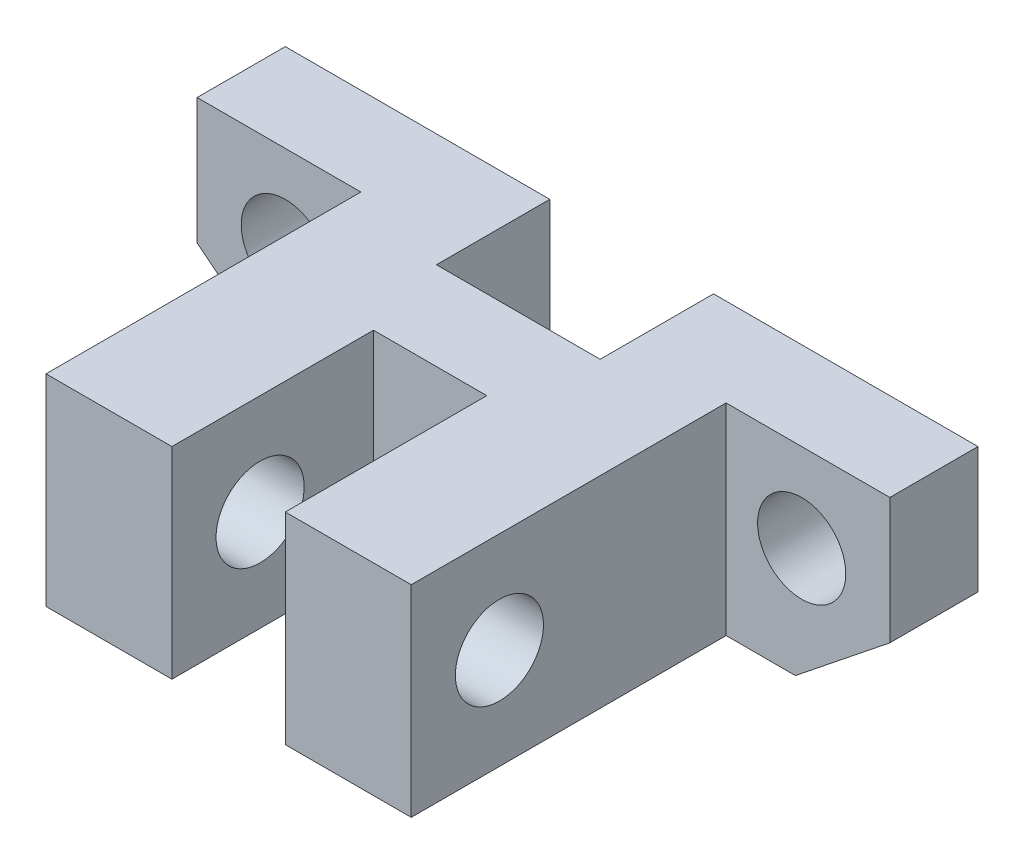
ISO-10303-21;
HEADER;
FILE_DESCRIPTION(('STEP AP214'),'2;1');
FILE_NAME('part.step','',(''),(''),'','','');
FILE_SCHEMA(('AUTOMOTIVE_DESIGN { 1 0 10303 214 1 1 1 1 }'));
ENDSEC;
DATA;
#1=APPLICATION_CONTEXT('core data for automotive mechanical design processes');
#2=APPLICATION_PROTOCOL_DEFINITION('international standard','automotive_design',2000,#1);
#3=PRODUCT_CONTEXT('',#1,'mechanical');
#4=PRODUCT('Part','Part','',(#3));
#5=PRODUCT_RELATED_PRODUCT_CATEGORY('part','',(#4));
#6=PRODUCT_DEFINITION_FORMATION('','',#4);
#7=PRODUCT_DEFINITION_CONTEXT('part definition',#1,'design');
#8=PRODUCT_DEFINITION('design','',#6,#7);
#9=PRODUCT_DEFINITION_SHAPE('','',#8);
#10=(LENGTH_UNIT() NAMED_UNIT(*) SI_UNIT(.MILLI.,.METRE.));
#11=(NAMED_UNIT(*) PLANE_ANGLE_UNIT() SI_UNIT($,.RADIAN.));
#12=(NAMED_UNIT(*) SI_UNIT($,.STERADIAN.) SOLID_ANGLE_UNIT());
#13=UNCERTAINTY_MEASURE_WITH_UNIT(LENGTH_MEASURE(1.E-05),#10,'distance_accuracy_value','');
#14=(GEOMETRIC_REPRESENTATION_CONTEXT(3) GLOBAL_UNCERTAINTY_ASSIGNED_CONTEXT((#13)) GLOBAL_UNIT_ASSIGNED_CONTEXT((#10,
#11,#12)) REPRESENTATION_CONTEXT('',''));
#15=CARTESIAN_POINT('',(0.,0.,0.));
#16=DIRECTION('',(0.,0.,1.));
#17=DIRECTION('',(1.,0.,0.));
#18=AXIS2_PLACEMENT_3D('',#15,#16,#17);
#19=CARTESIAN_POINT('',(0.,0.,32.));
#20=DIRECTION('',(0.,0.,1.));
#21=DIRECTION('',(1.,0.,0.));
#22=AXIS2_PLACEMENT_3D('',#19,#20,#21);
#23=PLANE('',#22);
#24=DIRECTION('',(0.,1.,0.));
#25=VECTOR('',#24,1.);
#26=CARTESIAN_POINT('',(4.5,0.,32.));
#27=LINE('',#26,#25);
#28=CARTESIAN_POINT('',(4.5,-11.,32.));
#29=VERTEX_POINT('',#28);
#30=CARTESIAN_POINT('',(4.5,5.,32.));
#31=VERTEX_POINT('',#30);
#32=EDGE_CURVE('E210',#29,#31,#27,.T.);
#33=ORIENTED_EDGE('',*,*,#32,.F.);
#34=DIRECTION('',(1.,0.,0.));
#35=VECTOR('',#34,1.);
#36=CARTESIAN_POINT('',(-20.,-11.,32.));
#37=LINE('',#36,#35);
#38=CARTESIAN_POINT('',(14.5,-11.,32.));
#39=VERTEX_POINT('',#38);
#40=EDGE_CURVE('E294',#29,#39,#37,.T.);
#41=ORIENTED_EDGE('',*,*,#40,.T.);
#42=DIRECTION('',(0.,1.,0.));
#43=VECTOR('',#42,1.);
#44=CARTESIAN_POINT('',(14.5,0.,32.));
#45=LINE('',#44,#43);
#46=CARTESIAN_POINT('',(14.5,5.,32.));
#47=VERTEX_POINT('',#46);
#48=EDGE_CURVE('E344',#39,#47,#45,.T.);
#49=ORIENTED_EDGE('',*,*,#48,.T.);
#50=DIRECTION('',(-1.,0.,0.));
#51=VECTOR('',#50,1.);
#52=CARTESIAN_POINT('',(-27.5,5.,32.));
#53=LINE('',#52,#51);
#54=EDGE_CURVE('E290',#47,#31,#53,.T.);
#55=ORIENTED_EDGE('',*,*,#54,.T.);
#56=EDGE_LOOP('',(#33,#41,#49,#55));
#57=FACE_BOUND('',#56,.T.);
#58=ADVANCED_FACE('F45',(#57),#23,.T.);
#59=CARTESIAN_POINT('',(0.,0.,0.));
#60=DIRECTION('',(0.,0.,1.));
#61=DIRECTION('',(1.,0.,0.));
#62=AXIS2_PLACEMENT_3D('',#59,#60,#61);
#63=PLANE('',#62);
#64=CARTESIAN_POINT('',(20.5,-2.,0.));
#65=DIRECTION('',(0.,0.,1.));
#66=DIRECTION('',(1.,0.,0.));
#67=AXIS2_PLACEMENT_3D('',#64,#65,#66);
#68=CIRCLE('',#67,3.5);
#69=CARTESIAN_POINT('',(24.,-2.,0.));
#70=VERTEX_POINT('',#69);
#71=EDGE_CURVE('E632',#70,#70,#68,.T.);
#72=ORIENTED_EDGE('',*,*,#71,.T.);
#73=EDGE_LOOP('',(#72));
#74=FACE_BOUND('',#73,.T.);
#75=DIRECTION('',(1.,0.,0.));
#76=VECTOR('',#75,1.);
#77=CARTESIAN_POINT('',(-20.,-11.,0.));
#78=LINE('',#77,#76);
#79=CARTESIAN_POINT('',(6.5,-11.,0.));
#80=VERTEX_POINT('',#79);
#81=CARTESIAN_POINT('',(20.,-11.,0.));
#82=VERTEX_POINT('',#81);
#83=EDGE_CURVE('E320',#80,#82,#78,.T.);
#84=ORIENTED_EDGE('',*,*,#83,.F.);
#85=DIRECTION('',(0.,-1.,0.));
#86=VECTOR('',#85,1.);
#87=CARTESIAN_POINT('',(6.5,5.,0.));
#88=LINE('',#87,#86);
#89=CARTESIAN_POINT('',(6.5,5.,0.));
#90=VERTEX_POINT('',#89);
#91=EDGE_CURVE('E236',#90,#80,#88,.T.);
#92=ORIENTED_EDGE('',*,*,#91,.F.);
#93=DIRECTION('',(-1.,0.,0.));
#94=VECTOR('',#93,1.);
#95=CARTESIAN_POINT('',(-27.5,5.,0.));
#96=LINE('',#95,#94);
#97=CARTESIAN_POINT('',(27.5,5.,0.));
#98=VERTEX_POINT('',#97);
#99=EDGE_CURVE('E308',#98,#90,#96,.T.);
#100=ORIENTED_EDGE('',*,*,#99,.F.);
#101=DIRECTION('',(0.,1.,0.));
#102=VECTOR('',#101,1.);
#103=CARTESIAN_POINT('',(27.5,5.,0.));
#104=LINE('',#103,#102);
#105=CARTESIAN_POINT('',(27.5,-5.,0.));
#106=VERTEX_POINT('',#105);
#107=EDGE_CURVE('E303',#106,#98,#104,.T.);
#108=ORIENTED_EDGE('',*,*,#107,.F.);
#109=DIRECTION('',(0.780868809443031,0.624695047554424,0.));
#110=VECTOR('',#109,1.);
#111=CARTESIAN_POINT('',(20.,-11.,0.));
#112=LINE('',#111,#110);
#113=EDGE_CURVE('E289',#82,#106,#112,.T.);
#114=ORIENTED_EDGE('',*,*,#113,.F.);
#115=EDGE_LOOP('',(#84,#92,#100,#108,#114));
#116=FACE_BOUND('',#115,.T.);
#117=ADVANCED_FACE('F387',(#74,#116),#63,.F.);
#118=DIRECTION('',(0.,-1.,0.));
#119=VECTOR('',#118,1.);
#120=CARTESIAN_POINT('',(-4.5,0.,32.));
#121=LINE('',#120,#119);
#122=CARTESIAN_POINT('',(-4.5,5.,32.));
#123=VERTEX_POINT('',#122);
#124=CARTESIAN_POINT('',(-4.5,-11.,32.));
#125=VERTEX_POINT('',#124);
#126=EDGE_CURVE('E62',#123,#125,#121,.T.);
#127=ORIENTED_EDGE('',*,*,#126,.F.);
#128=CARTESIAN_POINT('',(-14.5,5.,32.));
#129=VERTEX_POINT('',#128);
#130=EDGE_CURVE('E191',#123,#129,#53,.T.);
#131=ORIENTED_EDGE('',*,*,#130,.T.);
#132=DIRECTION('',(0.,-1.,0.));
#133=VECTOR('',#132,1.);
#134=CARTESIAN_POINT('',(-14.5,0.,32.));
#135=LINE('',#134,#133);
#136=CARTESIAN_POINT('',(-14.5,-11.,32.));
#137=VERTEX_POINT('',#136);
#138=EDGE_CURVE('E251',#129,#137,#135,.T.);
#139=ORIENTED_EDGE('',*,*,#138,.T.);
#140=EDGE_CURVE('E295',#137,#125,#37,.T.);
#141=ORIENTED_EDGE('',*,*,#140,.T.);
#142=EDGE_LOOP('',(#127,#131,#139,#141));
#143=FACE_BOUND('',#142,.T.);
#144=ADVANCED_FACE('F411',(#143),#23,.T.);
#145=CARTESIAN_POINT('',(20.,-11.,32.));
#146=DIRECTION('',(-0.624695047554424,0.780868809443031,0.));
#147=DIRECTION('',(-0.780868809443031,-0.624695047554424,0.));
#148=AXIS2_PLACEMENT_3D('',#145,#146,#147);
#149=PLANE('',#148);
#150=DIRECTION('',(0.,0.,-1.));
#151=VECTOR('',#150,1.);
#152=CARTESIAN_POINT('',(27.5,-5.,32.));
#153=LINE('',#152,#151);
#154=CARTESIAN_POINT('',(27.5,-5.,7.));
#155=VERTEX_POINT('',#154);
#156=EDGE_CURVE('E341',#155,#106,#153,.T.);
#157=ORIENTED_EDGE('',*,*,#156,.F.);
#158=DIRECTION('',(-0.780868809443031,-0.624695047554424,0.));
#159=VECTOR('',#158,1.);
#160=CARTESIAN_POINT('',(20.,-11.,6.99999999999999));
#161=LINE('',#160,#159);
#162=CARTESIAN_POINT('',(20.,-11.,7.));
#163=VERTEX_POINT('',#162);
#164=EDGE_CURVE('E281',#155,#163,#161,.T.);
#165=ORIENTED_EDGE('',*,*,#164,.T.);
#166=DIRECTION('',(0.,0.,-1.));
#167=VECTOR('',#166,1.);
#168=CARTESIAN_POINT('',(20.,-11.,32.));
#169=LINE('',#168,#167);
#170=EDGE_CURVE('E299',#163,#82,#169,.T.);
#171=ORIENTED_EDGE('',*,*,#170,.T.);
#172=ORIENTED_EDGE('',*,*,#113,.T.);
#173=EDGE_LOOP('',(#157,#165,#171,#172));
#174=FACE_BOUND('',#173,.T.);
#175=ADVANCED_FACE('F47',(#174),#149,.F.);
#176=CARTESIAN_POINT('',(27.5,5.,32.));
#177=DIRECTION('',(-1.,0.,0.));
#178=DIRECTION('',(0.,0.,1.));
#179=AXIS2_PLACEMENT_3D('',#176,#177,#178);
#180=PLANE('',#179);
#181=DIRECTION('',(0.,0.,-1.));
#182=VECTOR('',#181,1.);
#183=CARTESIAN_POINT('',(27.5,5.,32.));
#184=LINE('',#183,#182);
#185=CARTESIAN_POINT('',(27.5,5.,7.));
#186=VERTEX_POINT('',#185);
#187=EDGE_CURVE('E338',#186,#98,#184,.T.);
#188=ORIENTED_EDGE('',*,*,#187,.F.);
#189=DIRECTION('',(0.,1.,0.));
#190=VECTOR('',#189,1.);
#191=CARTESIAN_POINT('',(27.5,16.7277578085355,7.));
#192=LINE('',#191,#190);
#193=EDGE_CURVE('E268',#155,#186,#192,.T.);
#194=ORIENTED_EDGE('',*,*,#193,.F.);
#195=ORIENTED_EDGE('',*,*,#156,.T.);
#196=ORIENTED_EDGE('',*,*,#107,.T.);
#197=EDGE_LOOP('',(#188,#194,#195,#196));
#198=FACE_BOUND('',#197,.T.);
#199=ADVANCED_FACE('F394',(#198),#180,.F.);
#200=CARTESIAN_POINT('',(-27.5,5.,32.));
#201=DIRECTION('',(0.,-1.,0.));
#202=DIRECTION('',(0.,0.,-1.));
#203=AXIS2_PLACEMENT_3D('',#200,#201,#202);
#204=PLANE('',#203);
#205=DIRECTION('',(1.,0.,0.));
#206=VECTOR('',#205,1.);
#207=CARTESIAN_POINT('',(-4.5,5.,16.));
#208=LINE('',#207,#206);
#209=CARTESIAN_POINT('',(-4.5,5.,16.));
#210=VERTEX_POINT('',#209);
#211=CARTESIAN_POINT('',(4.5,5.,16.));
#212=VERTEX_POINT('',#211);
#213=EDGE_CURVE('E179',#210,#212,#208,.T.);
#214=ORIENTED_EDGE('',*,*,#213,.T.);
#215=DIRECTION('',(0.,0.,1.));
#216=VECTOR('',#215,1.);
#217=CARTESIAN_POINT('',(4.5,5.,16.));
#218=LINE('',#217,#216);
#219=EDGE_CURVE('E193',#212,#31,#218,.T.);
#220=ORIENTED_EDGE('',*,*,#219,.T.);
#221=ORIENTED_EDGE('',*,*,#54,.F.);
#222=DIRECTION('',(0.,0.,1.));
#223=VECTOR('',#222,1.);
#224=CARTESIAN_POINT('',(14.5,5.,32.));
#225=LINE('',#224,#223);
#226=CARTESIAN_POINT('',(14.5,5.,7.));
#227=VERTEX_POINT('',#226);
#228=EDGE_CURVE('E278',#227,#47,#225,.T.);
#229=ORIENTED_EDGE('',*,*,#228,.F.);
#230=DIRECTION('',(1.,0.,0.));
#231=VECTOR('',#230,1.);
#232=CARTESIAN_POINT('',(-27.5,5.,7.));
#233=LINE('',#232,#231);
#234=EDGE_CURVE('E285',#227,#186,#233,.T.);
#235=ORIENTED_EDGE('',*,*,#234,.T.);
#236=ORIENTED_EDGE('',*,*,#187,.T.);
#237=ORIENTED_EDGE('',*,*,#99,.T.);
#238=DIRECTION('',(0.,0.,1.));
#239=VECTOR('',#238,1.);
#240=CARTESIAN_POINT('',(6.5,5.,9.));
#241=LINE('',#240,#239);
#242=CARTESIAN_POINT('',(6.5,5.,9.));
#243=VERTEX_POINT('',#242);
#244=EDGE_CURVE('E214',#90,#243,#241,.T.);
#245=ORIENTED_EDGE('',*,*,#244,.T.);
#246=DIRECTION('',(-1.,0.,0.));
#247=VECTOR('',#246,1.);
#248=CARTESIAN_POINT('',(-6.5,5.,9.));
#249=LINE('',#248,#247);
#250=CARTESIAN_POINT('',(-6.5,5.,9.));
#251=VERTEX_POINT('',#250);
#252=EDGE_CURVE('E218',#243,#251,#249,.T.);
#253=ORIENTED_EDGE('',*,*,#252,.T.);
#254=DIRECTION('',(0.,0.,-1.));
#255=VECTOR('',#254,1.);
#256=CARTESIAN_POINT('',(-6.5,5.,9.));
#257=LINE('',#256,#255);
#258=CARTESIAN_POINT('',(-6.5,5.,0.));
#259=VERTEX_POINT('',#258);
#260=EDGE_CURVE('E222',#251,#259,#257,.T.);
#261=ORIENTED_EDGE('',*,*,#260,.T.);
#262=CARTESIAN_POINT('',(-27.5,5.,0.));
#263=VERTEX_POINT('',#262);
#264=EDGE_CURVE('E307',#259,#263,#96,.T.);
#265=ORIENTED_EDGE('',*,*,#264,.T.);
#266=DIRECTION('',(0.,0.,-1.));
#267=VECTOR('',#266,1.);
#268=CARTESIAN_POINT('',(-27.5,5.,32.));
#269=LINE('',#268,#267);
#270=CARTESIAN_POINT('',(-27.5,5.,7.));
#271=VERTEX_POINT('',#270);
#272=EDGE_CURVE('E334',#271,#263,#269,.T.);
#273=ORIENTED_EDGE('',*,*,#272,.F.);
#274=DIRECTION('',(1.,0.,0.));
#275=VECTOR('',#274,1.);
#276=CARTESIAN_POINT('',(-27.5,5.,7.));
#277=LINE('',#276,#275);
#278=CARTESIAN_POINT('',(-14.5,5.,7.));
#279=VERTEX_POINT('',#278);
#280=EDGE_CURVE('E264',#271,#279,#277,.T.);
#281=ORIENTED_EDGE('',*,*,#280,.T.);
#282=DIRECTION('',(0.,0.,-1.));
#283=VECTOR('',#282,1.);
#284=CARTESIAN_POINT('',(-14.5,5.,32.));
#285=LINE('',#284,#283);
#286=EDGE_CURVE('E257',#129,#279,#285,.T.);
#287=ORIENTED_EDGE('',*,*,#286,.F.);
#288=ORIENTED_EDGE('',*,*,#130,.F.);
#289=DIRECTION('',(0.,0.,-1.));
#290=VECTOR('',#289,1.);
#291=CARTESIAN_POINT('',(-4.5,5.,16.));
#292=LINE('',#291,#290);
#293=EDGE_CURVE('E173',#123,#210,#292,.T.);
#294=ORIENTED_EDGE('',*,*,#293,.T.);
#295=EDGE_LOOP('',(#214,#220,#221,#229,#235,#236,#237,#245,#253,#261,#265,#273,#281,#287,#288,#294));
#296=FACE_BOUND('',#295,.T.);
#297=ADVANCED_FACE('F189',(#296),#204,.F.);
#298=CARTESIAN_POINT('',(-27.5,5.,32.));
#299=DIRECTION('',(1.,0.,0.));
#300=DIRECTION('',(0.,0.,-1.));
#301=AXIS2_PLACEMENT_3D('',#298,#299,#300);
#302=PLANE('',#301);
#303=DIRECTION('',(0.,0.,-1.));
#304=VECTOR('',#303,1.);
#305=CARTESIAN_POINT('',(-27.5,-5.,32.));
#306=LINE('',#305,#304);
#307=CARTESIAN_POINT('',(-27.5,-5.,7.));
#308=VERTEX_POINT('',#307);
#309=CARTESIAN_POINT('',(-27.5,-5.,0.));
#310=VERTEX_POINT('',#309);
#311=EDGE_CURVE('E331',#308,#310,#306,.T.);
#312=ORIENTED_EDGE('',*,*,#311,.F.);
#313=DIRECTION('',(0.,-1.,0.));
#314=VECTOR('',#313,1.);
#315=CARTESIAN_POINT('',(-27.5,10.7920474144833,7.));
#316=LINE('',#315,#314);
#317=EDGE_CURVE('E239',#271,#308,#316,.T.);
#318=ORIENTED_EDGE('',*,*,#317,.F.);
#319=ORIENTED_EDGE('',*,*,#272,.T.);
#320=DIRECTION('',(0.,-1.,0.));
#321=VECTOR('',#320,1.);
#322=CARTESIAN_POINT('',(-27.5,5.,0.));
#323=LINE('',#322,#321);
#324=EDGE_CURVE('E312',#263,#310,#323,.T.);
#325=ORIENTED_EDGE('',*,*,#324,.T.);
#326=EDGE_LOOP('',(#312,#318,#319,#325));
#327=FACE_BOUND('',#326,.T.);
#328=ADVANCED_FACE('F405',(#327),#302,.F.);
#329=CARTESIAN_POINT('',(-20.,-11.,32.));
#330=DIRECTION('',(0.624695047554424,0.78086880944303,0.));
#331=DIRECTION('',(-0.78086880944303,0.624695047554424,0.));
#332=AXIS2_PLACEMENT_3D('',#329,#330,#331);
#333=PLANE('',#332);
#334=DIRECTION('',(0.,0.,-1.));
#335=VECTOR('',#334,1.);
#336=CARTESIAN_POINT('',(-20.,-11.,32.));
#337=LINE('',#336,#335);
#338=CARTESIAN_POINT('',(-20.,-11.,7.));
#339=VERTEX_POINT('',#338);
#340=CARTESIAN_POINT('',(-20.,-11.,0.));
#341=VERTEX_POINT('',#340);
#342=EDGE_CURVE('E328',#339,#341,#337,.T.);
#343=ORIENTED_EDGE('',*,*,#342,.F.);
#344=DIRECTION('',(-0.78086880944303,0.624695047554424,0.));
#345=VECTOR('',#344,1.);
#346=CARTESIAN_POINT('',(-20.,-11.,7.));
#347=LINE('',#346,#345);
#348=EDGE_CURVE('E260',#339,#308,#347,.T.);
#349=ORIENTED_EDGE('',*,*,#348,.T.);
#350=ORIENTED_EDGE('',*,*,#311,.T.);
#351=DIRECTION('',(0.78086880944303,-0.624695047554424,0.));
#352=VECTOR('',#351,1.);
#353=CARTESIAN_POINT('',(-20.,-11.,0.));
#354=LINE('',#353,#352);
#355=EDGE_CURVE('E316',#310,#341,#354,.T.);
#356=ORIENTED_EDGE('',*,*,#355,.T.);
#357=EDGE_LOOP('',(#343,#349,#350,#356));
#358=FACE_BOUND('',#357,.T.);
#359=ADVANCED_FACE('F367',(#358),#333,.F.);
#360=CARTESIAN_POINT('',(-20.,-11.,32.));
#361=DIRECTION('',(0.,1.,0.));
#362=DIRECTION('',(0.,0.,1.));
#363=AXIS2_PLACEMENT_3D('',#360,#361,#362);
#364=PLANE('',#363);
#365=ORIENTED_EDGE('',*,*,#40,.F.);
#366=DIRECTION('',(0.,0.,1.));
#367=VECTOR('',#366,1.);
#368=CARTESIAN_POINT('',(4.5,-11.,16.));
#369=LINE('',#368,#367);
#370=CARTESIAN_POINT('',(4.5,-11.,16.));
#371=VERTEX_POINT('',#370);
#372=EDGE_CURVE('E200',#371,#29,#369,.T.);
#373=ORIENTED_EDGE('',*,*,#372,.F.);
#374=DIRECTION('',(1.,0.,0.));
#375=VECTOR('',#374,1.);
#376=CARTESIAN_POINT('',(-4.5,-11.,16.));
#377=LINE('',#376,#375);
#378=CARTESIAN_POINT('',(-4.5,-11.,16.));
#379=VERTEX_POINT('',#378);
#380=EDGE_CURVE('E196',#379,#371,#377,.T.);
#381=ORIENTED_EDGE('',*,*,#380,.F.);
#382=DIRECTION('',(0.,0.,1.));
#383=VECTOR('',#382,1.);
#384=CARTESIAN_POINT('',(-4.5,-11.,32.));
#385=LINE('',#384,#383);
#386=EDGE_CURVE('E11',#379,#125,#385,.T.);
#387=ORIENTED_EDGE('',*,*,#386,.T.);
#388=ORIENTED_EDGE('',*,*,#140,.F.);
#389=DIRECTION('',(0.,0.,1.));
#390=VECTOR('',#389,1.);
#391=CARTESIAN_POINT('',(-14.5,-11.,32.));
#392=LINE('',#391,#390);
#393=CARTESIAN_POINT('',(-14.5,-11.,7.));
#394=VERTEX_POINT('',#393);
#395=EDGE_CURVE('E352',#394,#137,#392,.T.);
#396=ORIENTED_EDGE('',*,*,#395,.F.);
#397=DIRECTION('',(-1.,0.,0.));
#398=VECTOR('',#397,1.);
#399=CARTESIAN_POINT('',(-20.,-11.,7.));
#400=LINE('',#399,#398);
#401=EDGE_CURVE('E55',#394,#339,#400,.T.);
#402=ORIENTED_EDGE('',*,*,#401,.T.);
#403=ORIENTED_EDGE('',*,*,#342,.T.);
#404=CARTESIAN_POINT('',(-6.5,-11.,0.));
#405=VERTEX_POINT('',#404);
#406=EDGE_CURVE('E321',#341,#405,#78,.T.);
#407=ORIENTED_EDGE('',*,*,#406,.T.);
#408=DIRECTION('',(0.,0.,-1.));
#409=VECTOR('',#408,1.);
#410=CARTESIAN_POINT('',(-6.5,-11.,9.));
#411=LINE('',#410,#409);
#412=CARTESIAN_POINT('',(-6.5,-11.,9.));
#413=VERTEX_POINT('',#412);
#414=EDGE_CURVE('E69',#413,#405,#411,.T.);
#415=ORIENTED_EDGE('',*,*,#414,.F.);
#416=DIRECTION('',(-1.,0.,0.));
#417=VECTOR('',#416,1.);
#418=CARTESIAN_POINT('',(-6.5,-11.,9.));
#419=LINE('',#418,#417);
#420=CARTESIAN_POINT('',(6.5,-11.,9.));
#421=VERTEX_POINT('',#420);
#422=EDGE_CURVE('E230',#421,#413,#419,.T.);
#423=ORIENTED_EDGE('',*,*,#422,.F.);
#424=DIRECTION('',(0.,0.,1.));
#425=VECTOR('',#424,1.);
#426=CARTESIAN_POINT('',(6.5,-11.,9.));
#427=LINE('',#426,#425);
#428=EDGE_CURVE('E213',#80,#421,#427,.T.);
#429=ORIENTED_EDGE('',*,*,#428,.F.);
#430=ORIENTED_EDGE('',*,*,#83,.T.);
#431=ORIENTED_EDGE('',*,*,#170,.F.);
#432=DIRECTION('',(-1.,0.,0.));
#433=VECTOR('',#432,1.);
#434=CARTESIAN_POINT('',(-20.,-11.,7.));
#435=LINE('',#434,#433);
#436=CARTESIAN_POINT('',(14.5,-11.,7.));
#437=VERTEX_POINT('',#436);
#438=EDGE_CURVE('E348',#163,#437,#435,.T.);
#439=ORIENTED_EDGE('',*,*,#438,.T.);
#440=DIRECTION('',(0.,0.,-1.));
#441=VECTOR('',#440,1.);
#442=CARTESIAN_POINT('',(14.5,-11.,32.));
#443=LINE('',#442,#441);
#444=EDGE_CURVE('E273',#39,#437,#443,.T.);
#445=ORIENTED_EDGE('',*,*,#444,.F.);
#446=EDGE_LOOP('',(#365,#373,#381,#387,#388,#396,#402,#403,#407,#415,#423,#429,#430,#431,#439,#445));
#447=FACE_BOUND('',#446,.T.);
#448=ADVANCED_FACE('F362',(#447),#364,.F.);
#449=CARTESIAN_POINT('',(-20.5,-2.,0.));
#450=DIRECTION('',(0.,0.,1.));
#451=DIRECTION('',(1.,0.,0.));
#452=AXIS2_PLACEMENT_3D('',#449,#450,#451);
#453=CIRCLE('',#452,3.5);
#454=CARTESIAN_POINT('',(-17.,-2.,0.));
#455=VERTEX_POINT('',#454);
#456=EDGE_CURVE('E643',#455,#455,#453,.T.);
#457=ORIENTED_EDGE('',*,*,#456,.T.);
#458=EDGE_LOOP('',(#457));
#459=FACE_BOUND('',#458,.T.);
#460=ORIENTED_EDGE('',*,*,#264,.F.);
#461=DIRECTION('',(0.,-1.,0.));
#462=VECTOR('',#461,1.);
#463=CARTESIAN_POINT('',(-6.5,5.,0.));
#464=LINE('',#463,#462);
#465=EDGE_CURVE('E240',#259,#405,#464,.T.);
#466=ORIENTED_EDGE('',*,*,#465,.T.);
#467=ORIENTED_EDGE('',*,*,#406,.F.);
#468=ORIENTED_EDGE('',*,*,#355,.F.);
#469=ORIENTED_EDGE('',*,*,#324,.F.);
#470=EDGE_LOOP('',(#460,#466,#467,#468,#469));
#471=FACE_BOUND('',#470,.T.);
#472=ADVANCED_FACE('F374',(#459,#471),#63,.F.);
#473=CARTESIAN_POINT('',(14.5,16.7277578085355,7.));
#474=DIRECTION('',(0.,0.,-1.));
#475=DIRECTION('',(0.,1.,0.));
#476=AXIS2_PLACEMENT_3D('',#473,#474,#475);
#477=PLANE('',#476);
#478=CARTESIAN_POINT('',(20.5,-2.,7.));
#479=DIRECTION('',(0.,0.,1.));
#480=DIRECTION('',(1.,0.,0.));
#481=AXIS2_PLACEMENT_3D('',#478,#479,#480);
#482=CIRCLE('',#481,3.5);
#483=CARTESIAN_POINT('',(24.,-2.,7.));
#484=VERTEX_POINT('',#483);
#485=EDGE_CURVE('E634',#484,#484,#482,.T.);
#486=ORIENTED_EDGE('',*,*,#485,.F.);
#487=EDGE_LOOP('',(#486));
#488=FACE_BOUND('',#487,.T.);
#489=DIRECTION('',(0.,1.,0.));
#490=VECTOR('',#489,1.);
#491=CARTESIAN_POINT('',(14.5,16.7277578085355,7.));
#492=LINE('',#491,#490);
#493=EDGE_CURVE('E269',#437,#227,#492,.T.);
#494=ORIENTED_EDGE('',*,*,#493,.F.);
#495=ORIENTED_EDGE('',*,*,#438,.F.);
#496=ORIENTED_EDGE('',*,*,#164,.F.);
#497=ORIENTED_EDGE('',*,*,#193,.T.);
#498=ORIENTED_EDGE('',*,*,#234,.F.);
#499=EDGE_LOOP('',(#494,#495,#496,#497,#498));
#500=FACE_BOUND('',#499,.T.);
#501=ADVANCED_FACE('F423',(#488,#500),#477,.F.);
#502=CARTESIAN_POINT('',(14.5,0.,0.));
#503=DIRECTION('',(1.,0.,0.));
#504=DIRECTION('',(0.,0.,-1.));
#505=AXIS2_PLACEMENT_3D('',#502,#503,#504);
#506=PLANE('',#505);
#507=CARTESIAN_POINT('',(14.5,-3.,25.));
#508=DIRECTION('',(1.,0.,0.));
#509=DIRECTION('',(0.,0.,-1.));
#510=AXIS2_PLACEMENT_3D('',#507,#508,#509);
#511=CIRCLE('',#510,3.5);
#512=CARTESIAN_POINT('',(14.5,-3.,21.5));
#513=VERTEX_POINT('',#512);
#514=EDGE_CURVE('E640',#513,#513,#511,.T.);
#515=ORIENTED_EDGE('',*,*,#514,.F.);
#516=EDGE_LOOP('',(#515));
#517=FACE_BOUND('',#516,.T.);
#518=ORIENTED_EDGE('',*,*,#228,.T.);
#519=ORIENTED_EDGE('',*,*,#48,.F.);
#520=ORIENTED_EDGE('',*,*,#444,.T.);
#521=ORIENTED_EDGE('',*,*,#493,.T.);
#522=EDGE_LOOP('',(#518,#519,#520,#521));
#523=FACE_BOUND('',#522,.T.);
#524=ADVANCED_FACE('F420',(#517,#523),#506,.T.);
#525=CARTESIAN_POINT('',(-14.5,10.7920474144833,7.));
#526=DIRECTION('',(0.,0.,-1.));
#527=DIRECTION('',(0.,1.,0.));
#528=AXIS2_PLACEMENT_3D('',#525,#526,#527);
#529=PLANE('',#528);
#530=CARTESIAN_POINT('',(-20.5,-2.,7.));
#531=DIRECTION('',(0.,0.,1.));
#532=DIRECTION('',(1.,0.,0.));
#533=AXIS2_PLACEMENT_3D('',#530,#531,#532);
#534=CIRCLE('',#533,3.5);
#535=CARTESIAN_POINT('',(-17.,-2.,7.));
#536=VERTEX_POINT('',#535);
#537=EDGE_CURVE('E636',#536,#536,#534,.T.);
#538=ORIENTED_EDGE('',*,*,#537,.F.);
#539=EDGE_LOOP('',(#538));
#540=FACE_BOUND('',#539,.T.);
#541=ORIENTED_EDGE('',*,*,#317,.T.);
#542=ORIENTED_EDGE('',*,*,#348,.F.);
#543=ORIENTED_EDGE('',*,*,#401,.F.);
#544=DIRECTION('',(0.,-1.,0.));
#545=VECTOR('',#544,1.);
#546=CARTESIAN_POINT('',(-14.5,10.7920474144833,7.));
#547=LINE('',#546,#545);
#548=EDGE_CURVE('E248',#279,#394,#547,.T.);
#549=ORIENTED_EDGE('',*,*,#548,.F.);
#550=ORIENTED_EDGE('',*,*,#280,.F.);
#551=EDGE_LOOP('',(#541,#542,#543,#549,#550));
#552=FACE_BOUND('',#551,.T.);
#553=ADVANCED_FACE('F406',(#540,#552),#529,.F.);
#554=CARTESIAN_POINT('',(-14.5,0.,0.));
#555=DIRECTION('',(-1.,0.,0.));
#556=DIRECTION('',(0.,0.,1.));
#557=AXIS2_PLACEMENT_3D('',#554,#555,#556);
#558=PLANE('',#557);
#559=CARTESIAN_POINT('',(-14.5,-3.,25.));
#560=DIRECTION('',(-1.,0.,0.));
#561=DIRECTION('',(0.,0.,1.));
#562=AXIS2_PLACEMENT_3D('',#559,#560,#561);
#563=CIRCLE('',#562,3.5);
#564=CARTESIAN_POINT('',(-14.5,-3.,28.5));
#565=VERTEX_POINT('',#564);
#566=EDGE_CURVE('E203',#565,#565,#563,.T.);
#567=ORIENTED_EDGE('',*,*,#566,.F.);
#568=EDGE_LOOP('',(#567));
#569=FACE_BOUND('',#568,.T.);
#570=ORIENTED_EDGE('',*,*,#286,.T.);
#571=ORIENTED_EDGE('',*,*,#548,.T.);
#572=ORIENTED_EDGE('',*,*,#395,.T.);
#573=ORIENTED_EDGE('',*,*,#138,.F.);
#574=EDGE_LOOP('',(#570,#571,#572,#573));
#575=FACE_BOUND('',#574,.T.);
#576=ADVANCED_FACE('F409',(#569,#575),#558,.T.);
#577=CARTESIAN_POINT('',(6.5,5.,9.));
#578=DIRECTION('',(1.,0.,0.));
#579=DIRECTION('',(0.,0.,-1.));
#580=AXIS2_PLACEMENT_3D('',#577,#578,#579);
#581=PLANE('',#580);
#582=ORIENTED_EDGE('',*,*,#428,.T.);
#583=DIRECTION('',(0.,-1.,0.));
#584=VECTOR('',#583,1.);
#585=CARTESIAN_POINT('',(6.5,5.,9.));
#586=LINE('',#585,#584);
#587=EDGE_CURVE('E226',#243,#421,#586,.T.);
#588=ORIENTED_EDGE('',*,*,#587,.F.);
#589=ORIENTED_EDGE('',*,*,#244,.F.);
#590=ORIENTED_EDGE('',*,*,#91,.T.);
#591=EDGE_LOOP('',(#582,#588,#589,#590));
#592=FACE_BOUND('',#591,.T.);
#593=ADVANCED_FACE('F383',(#592),#581,.F.);
#594=CARTESIAN_POINT('',(-6.5,5.,9.));
#595=DIRECTION('',(-1.,0.,0.));
#596=DIRECTION('',(0.,0.,1.));
#597=AXIS2_PLACEMENT_3D('',#594,#595,#596);
#598=PLANE('',#597);
#599=ORIENTED_EDGE('',*,*,#414,.T.);
#600=ORIENTED_EDGE('',*,*,#465,.F.);
#601=ORIENTED_EDGE('',*,*,#260,.F.);
#602=DIRECTION('',(0.,-1.,0.));
#603=VECTOR('',#602,1.);
#604=CARTESIAN_POINT('',(-6.5,5.,9.));
#605=LINE('',#604,#603);
#606=EDGE_CURVE('E243',#251,#413,#605,.T.);
#607=ORIENTED_EDGE('',*,*,#606,.T.);
#608=EDGE_LOOP('',(#599,#600,#601,#607));
#609=FACE_BOUND('',#608,.T.);
#610=ADVANCED_FACE('F584',(#609),#598,.F.);
#611=CARTESIAN_POINT('',(-6.5,5.,9.));
#612=DIRECTION('',(0.,0.,1.));
#613=DIRECTION('',(1.,0.,0.));
#614=AXIS2_PLACEMENT_3D('',#611,#612,#613);
#615=PLANE('',#614);
#616=ORIENTED_EDGE('',*,*,#422,.T.);
#617=ORIENTED_EDGE('',*,*,#606,.F.);
#618=ORIENTED_EDGE('',*,*,#252,.F.);
#619=ORIENTED_EDGE('',*,*,#587,.T.);
#620=EDGE_LOOP('',(#616,#617,#618,#619));
#621=FACE_BOUND('',#620,.T.);
#622=ADVANCED_FACE('F379',(#621),#615,.F.);
#623=CARTESIAN_POINT('',(4.5,5.,16.));
#624=DIRECTION('',(1.,0.,0.));
#625=DIRECTION('',(0.,0.,-1.));
#626=AXIS2_PLACEMENT_3D('',#623,#624,#625);
#627=PLANE('',#626);
#628=CARTESIAN_POINT('',(4.5,-3.,25.));
#629=DIRECTION('',(1.,0.,0.));
#630=DIRECTION('',(0.,0.,-1.));
#631=AXIS2_PLACEMENT_3D('',#628,#629,#630);
#632=CIRCLE('',#631,3.5);
#633=CARTESIAN_POINT('',(4.5,-3.,21.5));
#634=VERTEX_POINT('',#633);
#635=EDGE_CURVE('E652',#634,#634,#632,.T.);
#636=ORIENTED_EDGE('',*,*,#635,.T.);
#637=EDGE_LOOP('',(#636));
#638=FACE_BOUND('',#637,.T.);
#639=ORIENTED_EDGE('',*,*,#32,.T.);
#640=ORIENTED_EDGE('',*,*,#219,.F.);
#641=DIRECTION('',(0.,-1.,0.));
#642=VECTOR('',#641,1.);
#643=CARTESIAN_POINT('',(4.5,5.,16.));
#644=LINE('',#643,#642);
#645=EDGE_CURVE('E178',#212,#371,#644,.T.);
#646=ORIENTED_EDGE('',*,*,#645,.T.);
#647=ORIENTED_EDGE('',*,*,#372,.T.);
#648=EDGE_LOOP('',(#639,#640,#646,#647));
#649=FACE_BOUND('',#648,.T.);
#650=ADVANCED_FACE('F415',(#638,#649),#627,.F.);
#651=CARTESIAN_POINT('',(-4.5,5.,16.));
#652=DIRECTION('',(0.,0.,-1.));
#653=DIRECTION('',(-1.,0.,0.));
#654=AXIS2_PLACEMENT_3D('',#651,#652,#653);
#655=PLANE('',#654);
#656=ORIENTED_EDGE('',*,*,#380,.T.);
#657=ORIENTED_EDGE('',*,*,#645,.F.);
#658=ORIENTED_EDGE('',*,*,#213,.F.);
#659=DIRECTION('',(0.,-1.,0.));
#660=VECTOR('',#659,1.);
#661=CARTESIAN_POINT('',(-4.5,5.,16.));
#662=LINE('',#661,#660);
#663=EDGE_CURVE('E169',#210,#379,#662,.T.);
#664=ORIENTED_EDGE('',*,*,#663,.T.);
#665=EDGE_LOOP('',(#656,#657,#658,#664));
#666=FACE_BOUND('',#665,.T.);
#667=ADVANCED_FACE('F182',(#666),#655,.F.);
#668=CARTESIAN_POINT('',(-4.5,5.,16.));
#669=DIRECTION('',(-1.,0.,0.));
#670=DIRECTION('',(0.,0.,1.));
#671=AXIS2_PLACEMENT_3D('',#668,#669,#670);
#672=PLANE('',#671);
#673=CARTESIAN_POINT('',(-4.5,-3.,25.));
#674=DIRECTION('',(-1.,0.,0.));
#675=DIRECTION('',(0.,0.,1.));
#676=AXIS2_PLACEMENT_3D('',#673,#674,#675);
#677=CIRCLE('',#676,3.5);
#678=CARTESIAN_POINT('',(-4.5,-3.,28.5));
#679=VERTEX_POINT('',#678);
#680=EDGE_CURVE('E49',#679,#679,#677,.T.);
#681=ORIENTED_EDGE('',*,*,#680,.T.);
#682=EDGE_LOOP('',(#681));
#683=FACE_BOUND('',#682,.T.);
#684=ORIENTED_EDGE('',*,*,#126,.T.);
#685=ORIENTED_EDGE('',*,*,#386,.F.);
#686=ORIENTED_EDGE('',*,*,#663,.F.);
#687=ORIENTED_EDGE('',*,*,#293,.F.);
#688=EDGE_LOOP('',(#684,#685,#686,#687));
#689=FACE_BOUND('',#688,.T.);
#690=ADVANCED_FACE('F171',(#683,#689),#672,.F.);
#691=CARTESIAN_POINT('',(-27.5,-3.,25.));
#692=DIRECTION('',(1.,0.,0.));
#693=DIRECTION('',(0.,0.,-1.));
#694=AXIS2_PLACEMENT_3D('',#691,#692,#693);
#695=CYLINDRICAL_SURFACE('',#694,3.5);
#696=ORIENTED_EDGE('',*,*,#566,.T.);
#697=EDGE_LOOP('',(#696));
#698=FACE_BOUND('',#697,.T.);
#699=ORIENTED_EDGE('',*,*,#680,.F.);
#700=EDGE_LOOP('',(#699));
#701=FACE_BOUND('',#700,.T.);
#702=ADVANCED_FACE('F505',(#698,#701),#695,.F.);
#703=ORIENTED_EDGE('',*,*,#514,.T.);
#704=EDGE_LOOP('',(#703));
#705=FACE_BOUND('',#704,.T.);
#706=ORIENTED_EDGE('',*,*,#635,.F.);
#707=EDGE_LOOP('',(#706));
#708=FACE_BOUND('',#707,.T.);
#709=ADVANCED_FACE('F514',(#705,#708),#695,.F.);
#710=CARTESIAN_POINT('',(-20.5,-2.,0.));
#711=DIRECTION('',(0.,0.,1.));
#712=DIRECTION('',(1.,0.,0.));
#713=AXIS2_PLACEMENT_3D('',#710,#711,#712);
#714=CYLINDRICAL_SURFACE('',#713,3.5);
#715=ORIENTED_EDGE('',*,*,#456,.F.);
#716=EDGE_LOOP('',(#715));
#717=FACE_BOUND('',#716,.T.);
#718=ORIENTED_EDGE('',*,*,#537,.T.);
#719=EDGE_LOOP('',(#718));
#720=FACE_BOUND('',#719,.T.);
#721=ADVANCED_FACE('F522',(#717,#720),#714,.F.);
#722=CARTESIAN_POINT('',(20.5,-2.,0.));
#723=DIRECTION('',(0.,0.,1.));
#724=DIRECTION('',(1.,0.,0.));
#725=AXIS2_PLACEMENT_3D('',#722,#723,#724);
#726=CYLINDRICAL_SURFACE('',#725,3.5);
#727=ORIENTED_EDGE('',*,*,#71,.F.);
#728=EDGE_LOOP('',(#727));
#729=FACE_BOUND('',#728,.T.);
#730=ORIENTED_EDGE('',*,*,#485,.T.);
#731=EDGE_LOOP('',(#730));
#732=FACE_BOUND('',#731,.T.);
#733=ADVANCED_FACE('F557',(#729,#732),#726,.F.);
#734=CLOSED_SHELL('',(#58,#117,#144,#175,#199,#297,#328,#359,#448,#472,#501,#524,#553,#576,#593,
#610,#622,#650,#667,#690,#702,#709,#721,#733));
#735=MANIFOLD_SOLID_BREP('B2',#734);
#736=ADVANCED_BREP_SHAPE_REPRESENTATION('',(#18,#735),#14);
#737=SHAPE_DEFINITION_REPRESENTATION(#9,#736);
ENDSEC;
END-ISO-10303-21;
